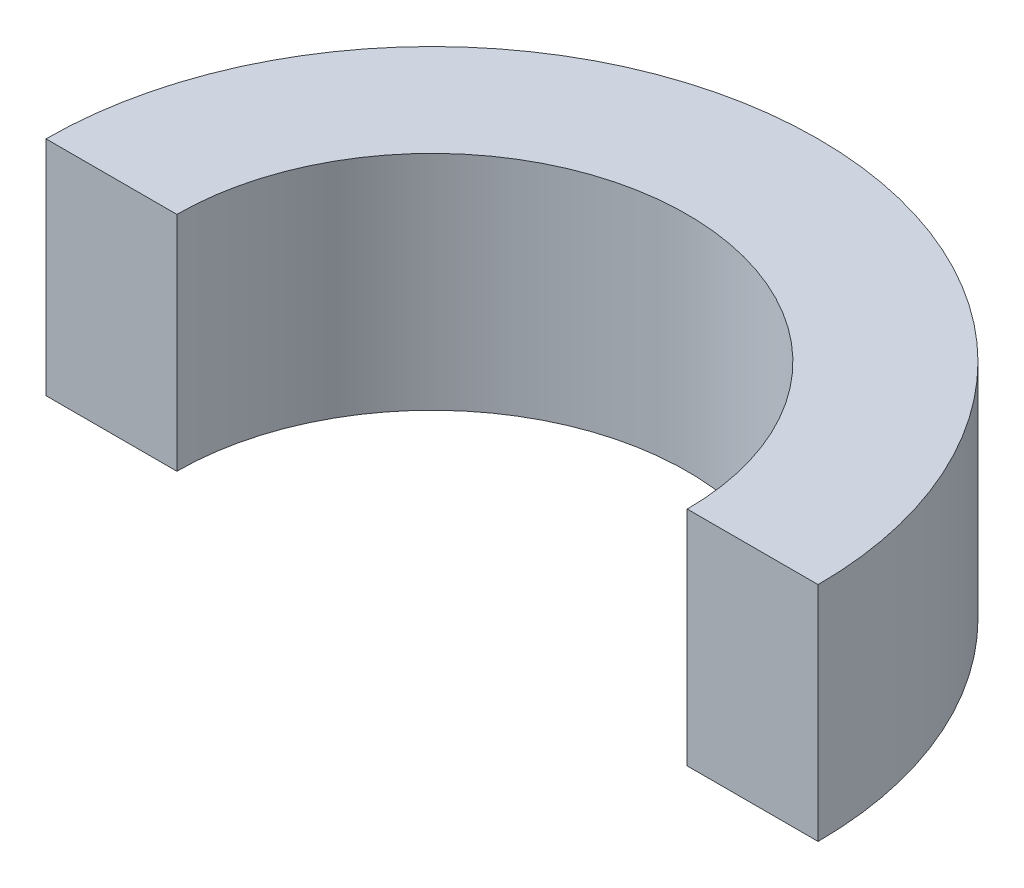
ISO-10303-21;
HEADER;
FILE_DESCRIPTION(('STEP AP214'),'2;1');
FILE_NAME('part.step','',(''),(''),'','','');
FILE_SCHEMA(('AUTOMOTIVE_DESIGN { 1 0 10303 214 1 1 1 1 }'));
ENDSEC;
DATA;
#1=APPLICATION_CONTEXT('core data for automotive mechanical design processes');
#2=APPLICATION_PROTOCOL_DEFINITION('international standard','automotive_design',2000,#1);
#3=PRODUCT_CONTEXT('',#1,'mechanical');
#4=PRODUCT('Part','Part','',(#3));
#5=PRODUCT_RELATED_PRODUCT_CATEGORY('part','',(#4));
#6=PRODUCT_DEFINITION_FORMATION('','',#4);
#7=PRODUCT_DEFINITION_CONTEXT('part definition',#1,'design');
#8=PRODUCT_DEFINITION('design','',#6,#7);
#9=PRODUCT_DEFINITION_SHAPE('','',#8);
#10=(LENGTH_UNIT() NAMED_UNIT(*) SI_UNIT(.MILLI.,.METRE.));
#11=(NAMED_UNIT(*) PLANE_ANGLE_UNIT() SI_UNIT($,.RADIAN.));
#12=(NAMED_UNIT(*) SI_UNIT($,.STERADIAN.) SOLID_ANGLE_UNIT());
#13=UNCERTAINTY_MEASURE_WITH_UNIT(LENGTH_MEASURE(1.E-05),#10,'distance_accuracy_value','');
#14=(GEOMETRIC_REPRESENTATION_CONTEXT(3) GLOBAL_UNCERTAINTY_ASSIGNED_CONTEXT((#13)) GLOBAL_UNIT_ASSIGNED_CONTEXT((#10,
#11,#12)) REPRESENTATION_CONTEXT('',''));
#15=CARTESIAN_POINT('',(0.,0.,0.));
#16=DIRECTION('',(0.,0.,1.));
#17=DIRECTION('',(1.,0.,0.));
#18=AXIS2_PLACEMENT_3D('',#15,#16,#17);
#19=CARTESIAN_POINT('',(0.,17.,0.));
#20=DIRECTION('',(0.,-1.,0.));
#21=DIRECTION('',(0.,0.,-1.));
#22=AXIS2_PLACEMENT_3D('',#19,#20,#21);
#23=CYLINDRICAL_SURFACE('',#22,29.5);
#24=CARTESIAN_POINT('',(0.,0.,0.));
#25=DIRECTION('',(0.,1.,0.));
#26=DIRECTION('',(0.,0.,1.));
#27=AXIS2_PLACEMENT_3D('',#24,#25,#26);
#28=CIRCLE('',#27,29.5);
#29=CARTESIAN_POINT('',(-29.5,0.,0.));
#30=VERTEX_POINT('',#29);
#31=CARTESIAN_POINT('',(29.5,0.,0.));
#32=VERTEX_POINT('',#31);
#33=EDGE_CURVE('E113',#30,#32,#28,.F.);
#34=ORIENTED_EDGE('',*,*,#33,.F.);
#35=DIRECTION('',(0.,-1.,0.));
#36=VECTOR('',#35,1.);
#37=CARTESIAN_POINT('',(-29.5,17.,0.));
#38=LINE('',#37,#36);
#39=CARTESIAN_POINT('',(-29.5,17.,0.));
#40=VERTEX_POINT('',#39);
#41=EDGE_CURVE('E11',#40,#30,#38,.T.);
#42=ORIENTED_EDGE('',*,*,#41,.F.);
#43=CARTESIAN_POINT('',(0.,17.,0.));
#44=DIRECTION('',(0.,1.,0.));
#45=DIRECTION('',(0.,0.,1.));
#46=AXIS2_PLACEMENT_3D('',#43,#44,#45);
#47=CIRCLE('',#46,29.5);
#48=CARTESIAN_POINT('',(29.5,17.,0.));
#49=VERTEX_POINT('',#48);
#50=EDGE_CURVE('E103',#40,#49,#47,.F.);
#51=ORIENTED_EDGE('',*,*,#50,.T.);
#52=DIRECTION('',(0.,-1.,0.));
#53=VECTOR('',#52,1.);
#54=CARTESIAN_POINT('',(29.5,17.,0.));
#55=LINE('',#54,#53);
#56=EDGE_CURVE('E84',#49,#32,#55,.T.);
#57=ORIENTED_EDGE('',*,*,#56,.T.);
#58=EDGE_LOOP('',(#34,#42,#51,#57));
#59=FACE_BOUND('',#58,.T.);
#60=ADVANCED_FACE('F45',(#59),#23,.T.);
#61=CARTESIAN_POINT('',(0.,17.,0.));
#62=DIRECTION('',(0.,0.,1.));
#63=DIRECTION('',(1.,0.,0.));
#64=AXIS2_PLACEMENT_3D('',#61,#62,#63);
#65=PLANE('',#64);
#66=DIRECTION('',(-1.,0.,0.));
#67=VECTOR('',#66,1.);
#68=CARTESIAN_POINT('',(0.,0.,0.));
#69=LINE('',#68,#67);
#70=CARTESIAN_POINT('',(-19.5,0.,0.));
#71=VERTEX_POINT('',#70);
#72=EDGE_CURVE('E95',#71,#30,#69,.T.);
#73=ORIENTED_EDGE('',*,*,#72,.F.);
#74=DIRECTION('',(0.,-1.,0.));
#75=VECTOR('',#74,1.);
#76=CARTESIAN_POINT('',(-19.5,17.,0.));
#77=LINE('',#76,#75);
#78=CARTESIAN_POINT('',(-19.5,17.,0.));
#79=VERTEX_POINT('',#78);
#80=EDGE_CURVE('E54',#79,#71,#77,.T.);
#81=ORIENTED_EDGE('',*,*,#80,.F.);
#82=DIRECTION('',(-1.,0.,0.));
#83=VECTOR('',#82,1.);
#84=CARTESIAN_POINT('',(0.,17.,0.));
#85=LINE('',#84,#83);
#86=EDGE_CURVE('E93',#79,#40,#85,.T.);
#87=ORIENTED_EDGE('',*,*,#86,.T.);
#88=ORIENTED_EDGE('',*,*,#41,.T.);
#89=EDGE_LOOP('',(#73,#81,#87,#88));
#90=FACE_BOUND('',#89,.T.);
#91=ADVANCED_FACE('F92',(#90),#65,.T.);
#92=CARTESIAN_POINT('',(0.,17.,0.));
#93=DIRECTION('',(0.,-1.,0.));
#94=DIRECTION('',(0.,0.,-1.));
#95=AXIS2_PLACEMENT_3D('',#92,#93,#94);
#96=CYLINDRICAL_SURFACE('',#95,19.5);
#97=CARTESIAN_POINT('',(0.,0.,0.));
#98=DIRECTION('',(0.,1.,0.));
#99=DIRECTION('',(0.,0.,1.));
#100=AXIS2_PLACEMENT_3D('',#97,#98,#99);
#101=CIRCLE('',#100,19.5);
#102=CARTESIAN_POINT('',(19.5,0.,0.));
#103=VERTEX_POINT('',#102);
#104=EDGE_CURVE('E119',#103,#71,#101,.T.);
#105=ORIENTED_EDGE('',*,*,#104,.F.);
#106=DIRECTION('',(0.,-1.,0.));
#107=VECTOR('',#106,1.);
#108=CARTESIAN_POINT('',(19.5,17.,0.));
#109=LINE('',#108,#107);
#110=CARTESIAN_POINT('',(19.5,17.,0.));
#111=VERTEX_POINT('',#110);
#112=EDGE_CURVE('E77',#111,#103,#109,.T.);
#113=ORIENTED_EDGE('',*,*,#112,.F.);
#114=CARTESIAN_POINT('',(0.,17.,0.));
#115=DIRECTION('',(0.,1.,0.));
#116=DIRECTION('',(0.,0.,1.));
#117=AXIS2_PLACEMENT_3D('',#114,#115,#116);
#118=CIRCLE('',#117,19.5);
#119=EDGE_CURVE('E102',#111,#79,#118,.T.);
#120=ORIENTED_EDGE('',*,*,#119,.T.);
#121=ORIENTED_EDGE('',*,*,#80,.T.);
#122=EDGE_LOOP('',(#105,#113,#120,#121));
#123=FACE_BOUND('',#122,.T.);
#124=ADVANCED_FACE('F106',(#123),#96,.F.);
#125=CARTESIAN_POINT('',(0.,17.,0.));
#126=DIRECTION('',(0.,0.,-1.));
#127=DIRECTION('',(-1.,0.,0.));
#128=AXIS2_PLACEMENT_3D('',#125,#126,#127);
#129=PLANE('',#128);
#130=DIRECTION('',(1.,0.,0.));
#131=VECTOR('',#130,1.);
#132=CARTESIAN_POINT('',(0.,0.,0.));
#133=LINE('',#132,#131);
#134=EDGE_CURVE('E122',#103,#32,#133,.T.);
#135=ORIENTED_EDGE('',*,*,#134,.T.);
#136=ORIENTED_EDGE('',*,*,#56,.F.);
#137=DIRECTION('',(1.,0.,0.));
#138=VECTOR('',#137,1.);
#139=CARTESIAN_POINT('',(0.,17.,0.));
#140=LINE('',#139,#138);
#141=EDGE_CURVE('E62',#111,#49,#140,.T.);
#142=ORIENTED_EDGE('',*,*,#141,.F.);
#143=ORIENTED_EDGE('',*,*,#112,.T.);
#144=EDGE_LOOP('',(#135,#136,#142,#143));
#145=FACE_BOUND('',#144,.T.);
#146=ADVANCED_FACE('F136',(#145),#129,.F.);
#147=CARTESIAN_POINT('',(0.,17.,0.));
#148=DIRECTION('',(0.,1.,0.));
#149=DIRECTION('',(0.,0.,1.));
#150=AXIS2_PLACEMENT_3D('',#147,#148,#149);
#151=PLANE('',#150);
#152=ORIENTED_EDGE('',*,*,#50,.F.);
#153=ORIENTED_EDGE('',*,*,#86,.F.);
#154=ORIENTED_EDGE('',*,*,#119,.F.);
#155=ORIENTED_EDGE('',*,*,#141,.T.);
#156=EDGE_LOOP('',(#152,#153,#154,#155));
#157=FACE_BOUND('',#156,.T.);
#158=ADVANCED_FACE('F101',(#157),#151,.T.);
#159=CARTESIAN_POINT('',(0.,0.,0.));
#160=DIRECTION('',(0.,1.,0.));
#161=DIRECTION('',(0.,0.,1.));
#162=AXIS2_PLACEMENT_3D('',#159,#160,#161);
#163=PLANE('',#162);
#164=ORIENTED_EDGE('',*,*,#33,.T.);
#165=ORIENTED_EDGE('',*,*,#134,.F.);
#166=ORIENTED_EDGE('',*,*,#104,.T.);
#167=ORIENTED_EDGE('',*,*,#72,.T.);
#168=EDGE_LOOP('',(#164,#165,#166,#167));
#169=FACE_BOUND('',#168,.T.);
#170=ADVANCED_FACE('F141',(#169),#163,.F.);
#171=CLOSED_SHELL('',(#60,#91,#124,#146,#158,#170));
#172=MANIFOLD_SOLID_BREP('B2',#171);
#173=ADVANCED_BREP_SHAPE_REPRESENTATION('',(#18,#172),#14);
#174=SHAPE_DEFINITION_REPRESENTATION(#9,#173);
ENDSEC;
END-ISO-10303-21;
